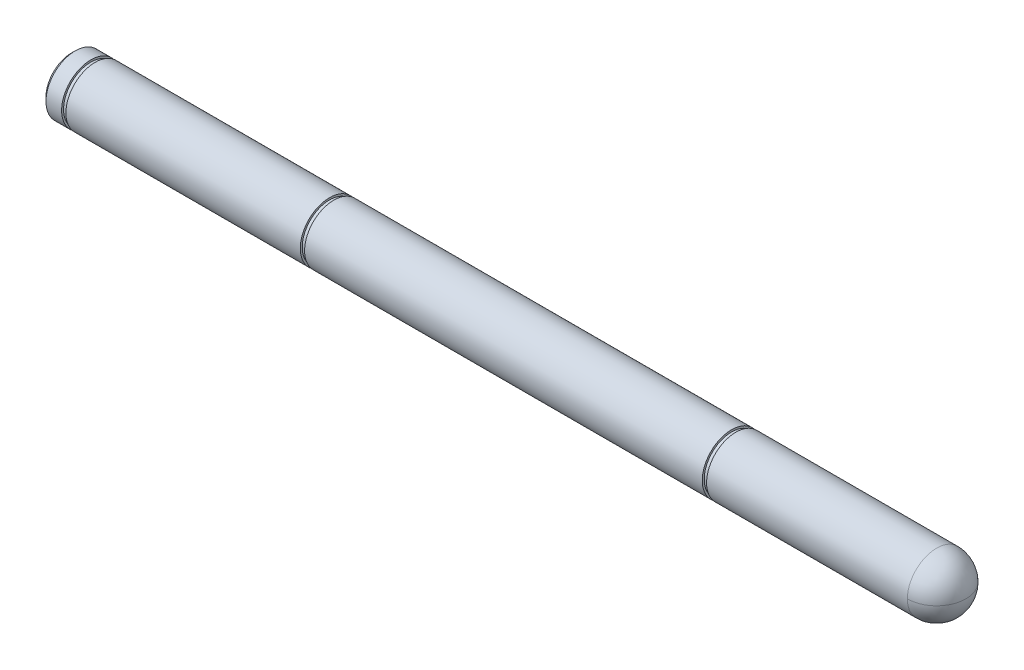
ISO-10303-21;
HEADER;
FILE_DESCRIPTION(('STEP AP214'),'2;1');
FILE_NAME('part.step','',(''),(''),'','','');
FILE_SCHEMA(('AUTOMOTIVE_DESIGN { 1 0 10303 214 1 1 1 1 }'));
ENDSEC;
DATA;
#1=APPLICATION_CONTEXT('core data for automotive mechanical design processes');
#2=APPLICATION_PROTOCOL_DEFINITION('international standard','automotive_design',2000,#1);
#3=PRODUCT_CONTEXT('',#1,'mechanical');
#4=PRODUCT('Part','Part','',(#3));
#5=PRODUCT_RELATED_PRODUCT_CATEGORY('part','',(#4));
#6=PRODUCT_DEFINITION_FORMATION('','',#4);
#7=PRODUCT_DEFINITION_CONTEXT('part definition',#1,'design');
#8=PRODUCT_DEFINITION('design','',#6,#7);
#9=PRODUCT_DEFINITION_SHAPE('','',#8);
#10=(LENGTH_UNIT() NAMED_UNIT(*) SI_UNIT(.MILLI.,.METRE.));
#11=(NAMED_UNIT(*) PLANE_ANGLE_UNIT() SI_UNIT($,.RADIAN.));
#12=(NAMED_UNIT(*) SI_UNIT($,.STERADIAN.) SOLID_ANGLE_UNIT());
#13=UNCERTAINTY_MEASURE_WITH_UNIT(LENGTH_MEASURE(1.E-05),#10,'distance_accuracy_value','');
#14=(GEOMETRIC_REPRESENTATION_CONTEXT(3) GLOBAL_UNCERTAINTY_ASSIGNED_CONTEXT((#13)) GLOBAL_UNIT_ASSIGNED_CONTEXT((#10,
#11,#12)) REPRESENTATION_CONTEXT('',''));
#15=CARTESIAN_POINT('',(0.,0.,0.));
#16=DIRECTION('',(0.,0.,1.));
#17=DIRECTION('',(1.,0.,0.));
#18=AXIS2_PLACEMENT_3D('',#15,#16,#17);
#19=CARTESIAN_POINT('',(-128.998653108,0.,0.));
#20=DIRECTION('',(1.,0.,0.));
#21=DIRECTION('',(0.,0.,-1.));
#22=AXIS2_PLACEMENT_3D('',#19,#20,#21);
#23=PLANE('',#22);
#24=CARTESIAN_POINT('',(-128.998653108,0.,-1.04805053526579E-13));
#25=DIRECTION('',(1.,0.,0.));
#26=DIRECTION('',(0.,0.,-1.));
#27=AXIS2_PLACEMENT_3D('',#24,#25,#26);
#28=CIRCLE('',#27,6.49980307283878);
#29=CARTESIAN_POINT('',(-128.998653108,0.,-6.49980307283888));
#30=VERTEX_POINT('',#29);
#31=EDGE_CURVE('E20',#30,#30,#28,.T.);
#32=ORIENTED_EDGE('',*,*,#31,.F.);
#33=EDGE_LOOP('',(#32));
#34=FACE_BOUND('',#33,.T.);
#35=ADVANCED_FACE('F17',(#34),#23,.F.);
#36=CARTESIAN_POINT('',(-127.998539496161,0.,-1.04805053526579E-13));
#37=DIRECTION('',(1.,0.,0.));
#38=DIRECTION('',(0.,0.,-1.));
#39=AXIS2_PLACEMENT_3D('',#36,#37,#38);
#40=CONICAL_SURFACE('',#39,7.49988638483501,0.785383014967778);
#41=CARTESIAN_POINT('',(-127.998425877554,0.,-1.04805053526579E-13));
#42=DIRECTION('',(1.,0.,0.));
#43=DIRECTION('',(0.,0.,-1.));
#44=AXIS2_PLACEMENT_3D('',#41,#42,#43);
#45=CIRCLE('',#44,7.5);
#46=CARTESIAN_POINT('',(-127.998425877554,0.,-7.5000000000001));
#47=VERTEX_POINT('',#46);
#48=EDGE_CURVE('E68',#47,#47,#45,.T.);
#49=ORIENTED_EDGE('',*,*,#48,.F.);
#50=EDGE_LOOP('',(#49));
#51=FACE_BOUND('',#50,.T.);
#52=ORIENTED_EDGE('',*,*,#31,.T.);
#53=EDGE_LOOP('',(#52));
#54=FACE_BOUND('',#53,.T.);
#55=ADVANCED_FACE('F75',(#51,#54),#40,.T.);
#56=CARTESIAN_POINT('',(-383.381670343,0.,0.));
#57=DIRECTION('',(1.,0.,0.));
#58=DIRECTION('',(0.,0.,-1.));
#59=AXIS2_PLACEMENT_3D('',#56,#57,#58);
#60=CYLINDRICAL_SURFACE('',#59,7.5);
#61=CARTESIAN_POINT('',(-123.998653108,0.,0.));
#62=DIRECTION('',(1.,0.,0.));
#63=DIRECTION('',(0.,0.,-1.));
#64=AXIS2_PLACEMENT_3D('',#61,#62,#63);
#65=CIRCLE('',#64,7.5);
#66=CARTESIAN_POINT('',(-123.998653108,0.,-7.5));
#67=VERTEX_POINT('',#66);
#68=EDGE_CURVE('E66',#67,#67,#65,.T.);
#69=ORIENTED_EDGE('',*,*,#68,.F.);
#70=EDGE_LOOP('',(#69));
#71=FACE_BOUND('',#70,.T.);
#72=ORIENTED_EDGE('',*,*,#48,.T.);
#73=EDGE_LOOP('',(#72));
#74=FACE_BOUND('',#73,.T.);
#75=ADVANCED_FACE('F82',(#71,#74),#60,.T.);
#76=CARTESIAN_POINT('',(-123.998653108,0.,0.));
#77=DIRECTION('',(1.,0.,0.));
#78=DIRECTION('',(0.,0.,-1.));
#79=AXIS2_PLACEMENT_3D('',#76,#77,#78);
#80=PLANE('',#79);
#81=CARTESIAN_POINT('',(-123.998653108,0.,0.));
#82=DIRECTION('',(1.,0.,0.));
#83=DIRECTION('',(0.,0.,-1.));
#84=AXIS2_PLACEMENT_3D('',#81,#82,#83);
#85=CIRCLE('',#84,7.);
#86=CARTESIAN_POINT('',(-123.998653108,0.,-7.));
#87=VERTEX_POINT('',#86);
#88=EDGE_CURVE('E48',#87,#87,#85,.T.);
#89=ORIENTED_EDGE('',*,*,#88,.F.);
#90=EDGE_LOOP('',(#89));
#91=FACE_BOUND('',#90,.T.);
#92=ORIENTED_EDGE('',*,*,#68,.T.);
#93=EDGE_LOOP('',(#92));
#94=FACE_BOUND('',#93,.T.);
#95=ADVANCED_FACE('F179',(#91,#94),#80,.T.);
#96=CARTESIAN_POINT('',(-383.381670343,0.,0.));
#97=DIRECTION('',(1.,0.,0.));
#98=DIRECTION('',(0.,0.,-1.));
#99=AXIS2_PLACEMENT_3D('',#96,#97,#98);
#100=CYLINDRICAL_SURFACE('',#99,7.);
#101=CARTESIAN_POINT('',(-122.898653108,0.,0.));
#102=DIRECTION('',(1.,0.,0.));
#103=DIRECTION('',(0.,0.,-1.));
#104=AXIS2_PLACEMENT_3D('',#101,#102,#103);
#105=CIRCLE('',#104,7.);
#106=CARTESIAN_POINT('',(-122.898653108,0.,-7.));
#107=VERTEX_POINT('',#106);
#108=EDGE_CURVE('E47',#107,#107,#105,.F.);
#109=ORIENTED_EDGE('',*,*,#108,.T.);
#110=EDGE_LOOP('',(#109));
#111=FACE_BOUND('',#110,.T.);
#112=ORIENTED_EDGE('',*,*,#88,.T.);
#113=EDGE_LOOP('',(#112));
#114=FACE_BOUND('',#113,.T.);
#115=ADVANCED_FACE('F176',(#111,#114),#100,.T.);
#116=CARTESIAN_POINT('',(92.5013468917,0.,0.));
#117=DIRECTION('',(0.,-1.,0.));
#118=DIRECTION('',(0.,0.,-1.));
#119=AXIS2_PLACEMENT_3D('',#116,#117,#118);
#120=SPHERICAL_SURFACE('',#119,7.5);
#121=CARTESIAN_POINT('',(92.5013468917,0.,0.));
#122=DIRECTION('',(1.,0.,0.));
#123=DIRECTION('',(0.,0.,-1.));
#124=AXIS2_PLACEMENT_3D('',#121,#122,#123);
#125=CIRCLE('',#124,7.5);
#126=CARTESIAN_POINT('',(92.5013468917,0.,7.5));
#127=VERTEX_POINT('',#126);
#128=CARTESIAN_POINT('',(92.5013468917,7.5,0.));
#129=VERTEX_POINT('',#128);
#130=EDGE_CURVE('E45',#127,#129,#125,.F.);
#131=ORIENTED_EDGE('',*,*,#130,.F.);
#132=CARTESIAN_POINT('',(92.5013468917,0.,0.));
#133=DIRECTION('',(0.,1.,0.));
#134=DIRECTION('',(0.,0.,1.));
#135=AXIS2_PLACEMENT_3D('',#132,#133,#134);
#136=CIRCLE('',#135,7.5);
#137=CARTESIAN_POINT('',(92.5013468917,0.,-7.5));
#138=VERTEX_POINT('',#137);
#139=EDGE_CURVE('E43',#138,#127,#136,.F.);
#140=ORIENTED_EDGE('',*,*,#139,.F.);
#141=CARTESIAN_POINT('',(92.5013468917,0.,0.));
#142=DIRECTION('',(1.,0.,0.));
#143=DIRECTION('',(0.,0.,-1.));
#144=AXIS2_PLACEMENT_3D('',#141,#142,#143);
#145=CIRCLE('',#144,7.5);
#146=EDGE_CURVE('E34',#129,#138,#145,.F.);
#147=ORIENTED_EDGE('',*,*,#146,.F.);
#148=EDGE_LOOP('',(#131,#140,#147));
#149=FACE_BOUND('',#148,.T.);
#150=ADVANCED_FACE('F44',(#149),#120,.T.);
#151=CARTESIAN_POINT('',(92.5013468917,0.,0.));
#152=DIRECTION('',(0.,1.,0.));
#153=DIRECTION('',(0.,0.,1.));
#154=AXIS2_PLACEMENT_3D('',#151,#152,#153);
#155=SPHERICAL_SURFACE('',#154,7.5);
#156=CARTESIAN_POINT('',(92.5013468917,0.,0.));
#157=DIRECTION('',(1.,0.,0.));
#158=DIRECTION('',(0.,0.,-1.));
#159=AXIS2_PLACEMENT_3D('',#156,#157,#158);
#160=CIRCLE('',#159,7.5);
#161=CARTESIAN_POINT('',(92.5013468917,-7.5,0.));
#162=VERTEX_POINT('',#161);
#163=EDGE_CURVE('E51',#138,#162,#160,.F.);
#164=ORIENTED_EDGE('',*,*,#163,.F.);
#165=ORIENTED_EDGE('',*,*,#139,.T.);
#166=CARTESIAN_POINT('',(92.5013468917,0.,0.));
#167=DIRECTION('',(1.,0.,0.));
#168=DIRECTION('',(0.,0.,-1.));
#169=AXIS2_PLACEMENT_3D('',#166,#167,#168);
#170=CIRCLE('',#169,7.5);
#171=EDGE_CURVE('E53',#162,#127,#170,.F.);
#172=ORIENTED_EDGE('',*,*,#171,.F.);
#173=EDGE_LOOP('',(#164,#165,#172));
#174=FACE_BOUND('',#173,.T.);
#175=ADVANCED_FACE('F52',(#174),#155,.T.);
#176=CARTESIAN_POINT('',(-122.898653108,0.,0.));
#177=DIRECTION('',(1.,0.,0.));
#178=DIRECTION('',(0.,0.,-1.));
#179=AXIS2_PLACEMENT_3D('',#176,#177,#178);
#180=PLANE('',#179);
#181=ORIENTED_EDGE('',*,*,#108,.F.);
#182=EDGE_LOOP('',(#181));
#183=FACE_BOUND('',#182,.T.);
#184=CARTESIAN_POINT('',(-122.898653108,0.,0.));
#185=DIRECTION('',(1.,0.,0.));
#186=DIRECTION('',(0.,0.,-1.));
#187=AXIS2_PLACEMENT_3D('',#184,#185,#186);
#188=CIRCLE('',#187,7.5);
#189=CARTESIAN_POINT('',(-122.898653108,0.,-7.5));
#190=VERTEX_POINT('',#189);
#191=EDGE_CURVE('E156',#190,#190,#188,.T.);
#192=ORIENTED_EDGE('',*,*,#191,.F.);
#193=EDGE_LOOP('',(#192));
#194=FACE_BOUND('',#193,.T.);
#195=ADVANCED_FACE('F122',(#183,#194),#180,.F.);
#196=CARTESIAN_POINT('',(-383.381670343,0.,0.));
#197=DIRECTION('',(1.,0.,0.));
#198=DIRECTION('',(0.,0.,-1.));
#199=AXIS2_PLACEMENT_3D('',#196,#197,#198);
#200=CYLINDRICAL_SURFACE('',#199,7.5);
#201=CARTESIAN_POINT('',(41.1013468917,0.,0.));
#202=DIRECTION('',(1.,0.,0.));
#203=DIRECTION('',(0.,0.,-1.));
#204=AXIS2_PLACEMENT_3D('',#201,#202,#203);
#205=CIRCLE('',#204,7.5);
#206=CARTESIAN_POINT('',(41.1013468917,0.,-7.5));
#207=VERTEX_POINT('',#206);
#208=EDGE_CURVE('E154',#207,#207,#205,.T.);
#209=ORIENTED_EDGE('',*,*,#208,.T.);
#210=EDGE_LOOP('',(#209));
#211=FACE_BOUND('',#210,.T.);
#212=ORIENTED_EDGE('',*,*,#171,.T.);
#213=ORIENTED_EDGE('',*,*,#130,.T.);
#214=ORIENTED_EDGE('',*,*,#146,.T.);
#215=ORIENTED_EDGE('',*,*,#163,.T.);
#216=EDGE_LOOP('',(#212,#213,#214,#215));
#217=FACE_BOUND('',#216,.T.);
#218=ADVANCED_FACE('F56',(#211,#217),#200,.T.);
#219=CARTESIAN_POINT('',(-383.381670343,0.,0.));
#220=DIRECTION('',(1.,0.,0.));
#221=DIRECTION('',(0.,0.,-1.));
#222=AXIS2_PLACEMENT_3D('',#219,#220,#221);
#223=CYLINDRICAL_SURFACE('',#222,7.5);
#224=ORIENTED_EDGE('',*,*,#191,.T.);
#225=EDGE_LOOP('',(#224));
#226=FACE_BOUND('',#225,.T.);
#227=CARTESIAN_POINT('',(-62.8986531083,0.,0.));
#228=DIRECTION('',(1.,0.,0.));
#229=DIRECTION('',(0.,0.,-1.));
#230=AXIS2_PLACEMENT_3D('',#227,#228,#229);
#231=CIRCLE('',#230,7.5);
#232=CARTESIAN_POINT('',(-62.8986531083,0.,-7.5));
#233=VERTEX_POINT('',#232);
#234=EDGE_CURVE('E151',#233,#233,#231,.T.);
#235=ORIENTED_EDGE('',*,*,#234,.F.);
#236=EDGE_LOOP('',(#235));
#237=FACE_BOUND('',#236,.T.);
#238=ADVANCED_FACE('F115',(#226,#237),#223,.T.);
#239=CARTESIAN_POINT('',(41.1013468917,0.,0.));
#240=DIRECTION('',(1.,0.,0.));
#241=DIRECTION('',(0.,0.,-1.));
#242=AXIS2_PLACEMENT_3D('',#239,#240,#241);
#243=PLANE('',#242);
#244=CARTESIAN_POINT('',(41.1013468917,0.,0.));
#245=DIRECTION('',(1.,0.,0.));
#246=DIRECTION('',(0.,0.,-1.));
#247=AXIS2_PLACEMENT_3D('',#244,#245,#246);
#248=CIRCLE('',#247,7.);
#249=CARTESIAN_POINT('',(41.1013468917,0.,-7.));
#250=VERTEX_POINT('',#249);
#251=EDGE_CURVE('E148',#250,#250,#248,.F.);
#252=ORIENTED_EDGE('',*,*,#251,.F.);
#253=EDGE_LOOP('',(#252));
#254=FACE_BOUND('',#253,.T.);
#255=ORIENTED_EDGE('',*,*,#208,.F.);
#256=EDGE_LOOP('',(#255));
#257=FACE_BOUND('',#256,.T.);
#258=ADVANCED_FACE('F111',(#254,#257),#243,.F.);
#259=CARTESIAN_POINT('',(-62.8986531083,0.,0.));
#260=DIRECTION('',(1.,0.,0.));
#261=DIRECTION('',(0.,0.,-1.));
#262=AXIS2_PLACEMENT_3D('',#259,#260,#261);
#263=PLANE('',#262);
#264=CARTESIAN_POINT('',(-62.8986531083,0.,0.));
#265=DIRECTION('',(1.,0.,0.));
#266=DIRECTION('',(0.,0.,-1.));
#267=AXIS2_PLACEMENT_3D('',#264,#265,#266);
#268=CIRCLE('',#267,7.);
#269=CARTESIAN_POINT('',(-62.8986531083,0.,-7.));
#270=VERTEX_POINT('',#269);
#271=EDGE_CURVE('E145',#270,#270,#268,.T.);
#272=ORIENTED_EDGE('',*,*,#271,.F.);
#273=EDGE_LOOP('',(#272));
#274=FACE_BOUND('',#273,.T.);
#275=ORIENTED_EDGE('',*,*,#234,.T.);
#276=EDGE_LOOP('',(#275));
#277=FACE_BOUND('',#276,.T.);
#278=ADVANCED_FACE('F107',(#274,#277),#263,.T.);
#279=CARTESIAN_POINT('',(-383.381670343,0.,0.));
#280=DIRECTION('',(1.,0.,0.));
#281=DIRECTION('',(0.,0.,-1.));
#282=AXIS2_PLACEMENT_3D('',#279,#280,#281);
#283=CYLINDRICAL_SURFACE('',#282,7.);
#284=ORIENTED_EDGE('',*,*,#251,.T.);
#285=EDGE_LOOP('',(#284));
#286=FACE_BOUND('',#285,.T.);
#287=CARTESIAN_POINT('',(40.0013468917,0.,0.));
#288=DIRECTION('',(1.,0.,0.));
#289=DIRECTION('',(0.,0.,-1.));
#290=AXIS2_PLACEMENT_3D('',#287,#288,#289);
#291=CIRCLE('',#290,7.);
#292=CARTESIAN_POINT('',(40.0013468917,0.,-7.));
#293=VERTEX_POINT('',#292);
#294=EDGE_CURVE('E142',#293,#293,#291,.F.);
#295=ORIENTED_EDGE('',*,*,#294,.F.);
#296=EDGE_LOOP('',(#295));
#297=FACE_BOUND('',#296,.T.);
#298=ADVANCED_FACE('F103',(#286,#297),#283,.T.);
#299=CARTESIAN_POINT('',(-383.381670343,0.,0.));
#300=DIRECTION('',(1.,0.,0.));
#301=DIRECTION('',(0.,0.,-1.));
#302=AXIS2_PLACEMENT_3D('',#299,#300,#301);
#303=CYLINDRICAL_SURFACE('',#302,7.);
#304=CARTESIAN_POINT('',(-61.7986531083,0.,0.));
#305=DIRECTION('',(1.,0.,0.));
#306=DIRECTION('',(0.,0.,-1.));
#307=AXIS2_PLACEMENT_3D('',#304,#305,#306);
#308=CIRCLE('',#307,7.);
#309=CARTESIAN_POINT('',(-61.7986531083,0.,-7.));
#310=VERTEX_POINT('',#309);
#311=EDGE_CURVE('E139',#310,#310,#308,.F.);
#312=ORIENTED_EDGE('',*,*,#311,.T.);
#313=EDGE_LOOP('',(#312));
#314=FACE_BOUND('',#313,.T.);
#315=ORIENTED_EDGE('',*,*,#271,.T.);
#316=EDGE_LOOP('',(#315));
#317=FACE_BOUND('',#316,.T.);
#318=ADVANCED_FACE('F99',(#314,#317),#303,.T.);
#319=CARTESIAN_POINT('',(40.0013468917,0.,0.));
#320=DIRECTION('',(1.,0.,0.));
#321=DIRECTION('',(0.,0.,-1.));
#322=AXIS2_PLACEMENT_3D('',#319,#320,#321);
#323=PLANE('',#322);
#324=ORIENTED_EDGE('',*,*,#294,.T.);
#325=EDGE_LOOP('',(#324));
#326=FACE_BOUND('',#325,.T.);
#327=CARTESIAN_POINT('',(40.0013468917,0.,0.));
#328=DIRECTION('',(1.,0.,0.));
#329=DIRECTION('',(0.,0.,-1.));
#330=AXIS2_PLACEMENT_3D('',#327,#328,#329);
#331=CIRCLE('',#330,7.5);
#332=CARTESIAN_POINT('',(40.0013468917,0.,-7.5));
#333=VERTEX_POINT('',#332);
#334=EDGE_CURVE('E26',#333,#333,#331,.F.);
#335=ORIENTED_EDGE('',*,*,#334,.F.);
#336=EDGE_LOOP('',(#335));
#337=FACE_BOUND('',#336,.T.);
#338=ADVANCED_FACE('F92',(#326,#337),#323,.T.);
#339=CARTESIAN_POINT('',(-61.7986531083,0.,0.));
#340=DIRECTION('',(1.,0.,0.));
#341=DIRECTION('',(0.,0.,-1.));
#342=AXIS2_PLACEMENT_3D('',#339,#340,#341);
#343=PLANE('',#342);
#344=ORIENTED_EDGE('',*,*,#311,.F.);
#345=EDGE_LOOP('',(#344));
#346=FACE_BOUND('',#345,.T.);
#347=CARTESIAN_POINT('',(-61.7986531083,0.,0.));
#348=DIRECTION('',(1.,0.,0.));
#349=DIRECTION('',(0.,0.,-1.));
#350=AXIS2_PLACEMENT_3D('',#347,#348,#349);
#351=CIRCLE('',#350,7.5);
#352=CARTESIAN_POINT('',(-61.7986531083,0.,-7.5));
#353=VERTEX_POINT('',#352);
#354=EDGE_CURVE('E11',#353,#353,#351,.T.);
#355=ORIENTED_EDGE('',*,*,#354,.F.);
#356=EDGE_LOOP('',(#355));
#357=FACE_BOUND('',#356,.T.);
#358=ADVANCED_FACE('F86',(#346,#357),#343,.F.);
#359=CARTESIAN_POINT('',(-383.381670343,0.,0.));
#360=DIRECTION('',(1.,0.,0.));
#361=DIRECTION('',(0.,0.,-1.));
#362=AXIS2_PLACEMENT_3D('',#359,#360,#361);
#363=CYLINDRICAL_SURFACE('',#362,7.5);
#364=ORIENTED_EDGE('',*,*,#354,.T.);
#365=EDGE_LOOP('',(#364));
#366=FACE_BOUND('',#365,.T.);
#367=ORIENTED_EDGE('',*,*,#334,.T.);
#368=EDGE_LOOP('',(#367));
#369=FACE_BOUND('',#368,.T.);
#370=ADVANCED_FACE('F84',(#366,#369),#363,.T.);
#371=CLOSED_SHELL('',(#35,#55,#75,#95,#115,#150,#175,#195,#218,#238,#258,#278,#298,#318,#338,
#358,#370));
#372=MANIFOLD_SOLID_BREP('B1',#371);
#373=ADVANCED_BREP_SHAPE_REPRESENTATION('',(#18,#372),#14);
#374=SHAPE_DEFINITION_REPRESENTATION(#9,#373);
ENDSEC;
END-ISO-10303-21;
